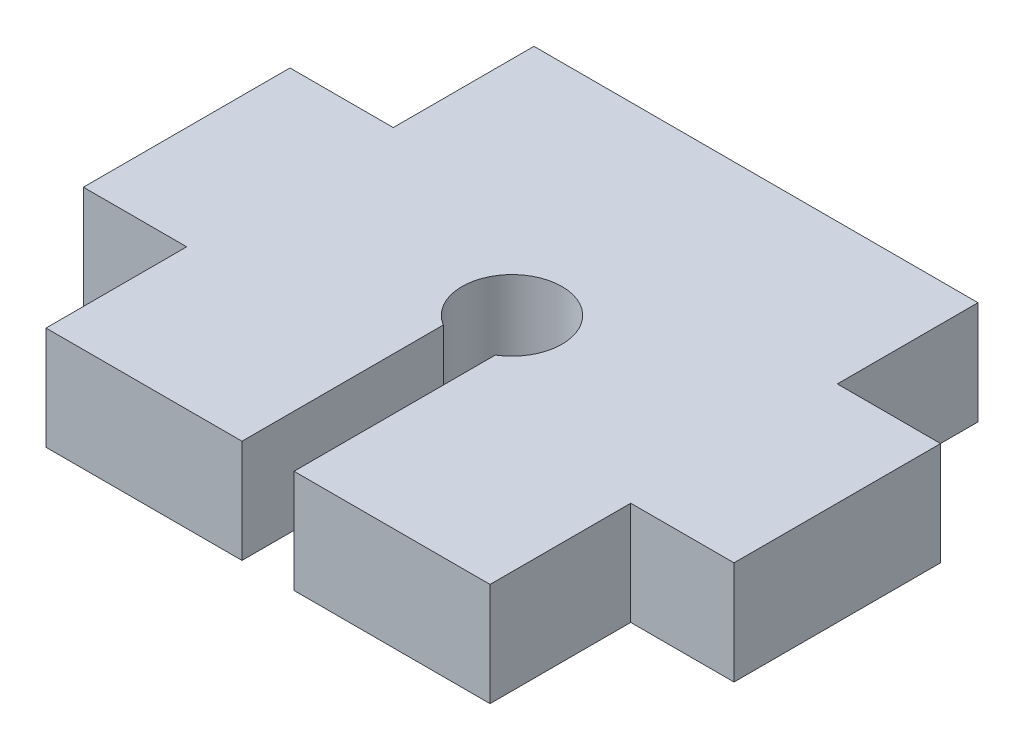
ISO-10303-21;
HEADER;
FILE_DESCRIPTION(('STEP AP214'),'2;1');
FILE_NAME('part.step','',(''),(''),'','','');
FILE_SCHEMA(('AUTOMOTIVE_DESIGN { 1 0 10303 214 1 1 1 1 }'));
ENDSEC;
DATA;
#1=APPLICATION_CONTEXT('core data for automotive mechanical design processes');
#2=APPLICATION_PROTOCOL_DEFINITION('international standard','automotive_design',2000,#1);
#3=PRODUCT_CONTEXT('',#1,'mechanical');
#4=PRODUCT('Part','Part','',(#3));
#5=PRODUCT_RELATED_PRODUCT_CATEGORY('part','',(#4));
#6=PRODUCT_DEFINITION_FORMATION('','',#4);
#7=PRODUCT_DEFINITION_CONTEXT('part definition',#1,'design');
#8=PRODUCT_DEFINITION('design','',#6,#7);
#9=PRODUCT_DEFINITION_SHAPE('','',#8);
#10=(LENGTH_UNIT() NAMED_UNIT(*) SI_UNIT(.MILLI.,.METRE.));
#11=(NAMED_UNIT(*) PLANE_ANGLE_UNIT() SI_UNIT($,.RADIAN.));
#12=(NAMED_UNIT(*) SI_UNIT($,.STERADIAN.) SOLID_ANGLE_UNIT());
#13=UNCERTAINTY_MEASURE_WITH_UNIT(LENGTH_MEASURE(1.E-05),#10,'distance_accuracy_value','');
#14=(GEOMETRIC_REPRESENTATION_CONTEXT(3) GLOBAL_UNCERTAINTY_ASSIGNED_CONTEXT((#13)) GLOBAL_UNIT_ASSIGNED_CONTEXT((#10,
#11,#12)) REPRESENTATION_CONTEXT('',''));
#15=CARTESIAN_POINT('',(0.,0.,0.));
#16=DIRECTION('',(0.,0.,1.));
#17=DIRECTION('',(1.,0.,0.));
#18=AXIS2_PLACEMENT_3D('',#15,#16,#17);
#19=CARTESIAN_POINT('',(-13.65,6.35,15.));
#20=DIRECTION('',(0.,0.,-1.));
#21=DIRECTION('',(-1.,0.,0.));
#22=AXIS2_PLACEMENT_3D('',#19,#20,#21);
#23=PLANE('',#22);
#24=DIRECTION('',(1.,0.,0.));
#25=VECTOR('',#24,1.);
#26=CARTESIAN_POINT('',(-13.65,0.,15.));
#27=LINE('',#26,#25);
#28=CARTESIAN_POINT('',(-13.65,0.,15.));
#29=VERTEX_POINT('',#28);
#30=CARTESIAN_POINT('',(-1.6,0.,15.));
#31=VERTEX_POINT('',#30);
#32=EDGE_CURVE('E230',#29,#31,#27,.T.);
#33=ORIENTED_EDGE('',*,*,#32,.T.);
#34=DIRECTION('',(0.,-1.,0.));
#35=VECTOR('',#34,1.);
#36=CARTESIAN_POINT('',(-1.6,0.,15.));
#37=LINE('',#36,#35);
#38=CARTESIAN_POINT('',(-1.6,6.35,15.));
#39=VERTEX_POINT('',#38);
#40=EDGE_CURVE('E462',#39,#31,#37,.T.);
#41=ORIENTED_EDGE('',*,*,#40,.F.);
#42=DIRECTION('',(1.,0.,0.));
#43=VECTOR('',#42,1.);
#44=CARTESIAN_POINT('',(-13.65,6.35,15.));
#45=LINE('',#44,#43);
#46=CARTESIAN_POINT('',(-13.65,6.35,15.));
#47=VERTEX_POINT('',#46);
#48=EDGE_CURVE('E253',#47,#39,#45,.T.);
#49=ORIENTED_EDGE('',*,*,#48,.F.);
#50=DIRECTION('',(0.,-1.,0.));
#51=VECTOR('',#50,1.);
#52=CARTESIAN_POINT('',(-13.65,6.35,15.));
#53=LINE('',#52,#51);
#54=EDGE_CURVE('E252',#47,#29,#53,.T.);
#55=ORIENTED_EDGE('',*,*,#54,.T.);
#56=EDGE_LOOP('',(#33,#41,#49,#55));
#57=FACE_BOUND('',#56,.T.);
#58=ADVANCED_FACE('F34',(#57),#23,.F.);
#59=CARTESIAN_POINT('',(-13.65,6.35,15.));
#60=DIRECTION('',(1.,0.,0.));
#61=DIRECTION('',(0.,0.,-1.));
#62=AXIS2_PLACEMENT_3D('',#59,#60,#61);
#63=PLANE('',#62);
#64=DIRECTION('',(0.,0.,1.));
#65=VECTOR('',#64,1.);
#66=CARTESIAN_POINT('',(-13.65,6.35,15.));
#67=LINE('',#66,#65);
#68=CARTESIAN_POINT('',(-13.65,6.35,6.35));
#69=VERTEX_POINT('',#68);
#70=EDGE_CURVE('E227',#69,#47,#67,.T.);
#71=ORIENTED_EDGE('',*,*,#70,.F.);
#72=DIRECTION('',(0.,-1.,0.));
#73=VECTOR('',#72,1.);
#74=CARTESIAN_POINT('',(-13.65,0.,6.35));
#75=LINE('',#74,#73);
#76=CARTESIAN_POINT('',(-13.65,0.,6.35));
#77=VERTEX_POINT('',#76);
#78=EDGE_CURVE('E165',#69,#77,#75,.T.);
#79=ORIENTED_EDGE('',*,*,#78,.T.);
#80=DIRECTION('',(0.,0.,1.));
#81=VECTOR('',#80,1.);
#82=CARTESIAN_POINT('',(-13.65,0.,15.));
#83=LINE('',#82,#81);
#84=EDGE_CURVE('E225',#77,#29,#83,.T.);
#85=ORIENTED_EDGE('',*,*,#84,.T.);
#86=ORIENTED_EDGE('',*,*,#54,.F.);
#87=EDGE_LOOP('',(#71,#79,#85,#86));
#88=FACE_BOUND('',#87,.T.);
#89=ADVANCED_FACE('F223',(#88),#63,.F.);
#90=CARTESIAN_POINT('',(13.65,6.35,15.));
#91=DIRECTION('',(-1.,0.,0.));
#92=DIRECTION('',(0.,0.,1.));
#93=AXIS2_PLACEMENT_3D('',#90,#91,#92);
#94=PLANE('',#93);
#95=DIRECTION('',(0.,-1.,0.));
#96=VECTOR('',#95,1.);
#97=CARTESIAN_POINT('',(13.65,0.,6.35));
#98=LINE('',#97,#96);
#99=CARTESIAN_POINT('',(13.65,6.35,6.35));
#100=VERTEX_POINT('',#99);
#101=CARTESIAN_POINT('',(13.65,0.,6.35));
#102=VERTEX_POINT('',#101);
#103=EDGE_CURVE('E196',#100,#102,#98,.T.);
#104=ORIENTED_EDGE('',*,*,#103,.F.);
#105=DIRECTION('',(0.,0.,-1.));
#106=VECTOR('',#105,1.);
#107=CARTESIAN_POINT('',(13.65,6.35,15.));
#108=LINE('',#107,#106);
#109=CARTESIAN_POINT('',(13.65,6.35,15.));
#110=VERTEX_POINT('',#109);
#111=EDGE_CURVE('E271',#110,#100,#108,.T.);
#112=ORIENTED_EDGE('',*,*,#111,.F.);
#113=DIRECTION('',(0.,-1.,0.));
#114=VECTOR('',#113,1.);
#115=CARTESIAN_POINT('',(13.65,6.35,15.));
#116=LINE('',#115,#114);
#117=CARTESIAN_POINT('',(13.65,0.,15.));
#118=VERTEX_POINT('',#117);
#119=EDGE_CURVE('E249',#110,#118,#116,.T.);
#120=ORIENTED_EDGE('',*,*,#119,.T.);
#121=DIRECTION('',(0.,0.,-1.));
#122=VECTOR('',#121,1.);
#123=CARTESIAN_POINT('',(13.65,0.,15.));
#124=LINE('',#123,#122);
#125=EDGE_CURVE('E236',#118,#102,#124,.T.);
#126=ORIENTED_EDGE('',*,*,#125,.T.);
#127=EDGE_LOOP('',(#104,#112,#120,#126));
#128=FACE_BOUND('',#127,.T.);
#129=ADVANCED_FACE('F36',(#128),#94,.F.);
#130=DIRECTION('',(0.,1.,0.));
#131=VECTOR('',#130,1.);
#132=CARTESIAN_POINT('',(13.65,0.,-6.35));
#133=LINE('',#132,#131);
#134=CARTESIAN_POINT('',(13.65,0.,-6.35));
#135=VERTEX_POINT('',#134);
#136=CARTESIAN_POINT('',(13.65,6.35,-6.35));
#137=VERTEX_POINT('',#136);
#138=EDGE_CURVE('E202',#135,#137,#133,.T.);
#139=ORIENTED_EDGE('',*,*,#138,.F.);
#140=CARTESIAN_POINT('',(13.65,0.,-15.));
#141=VERTEX_POINT('',#140);
#142=EDGE_CURVE('E258',#135,#141,#124,.T.);
#143=ORIENTED_EDGE('',*,*,#142,.T.);
#144=DIRECTION('',(0.,-1.,0.));
#145=VECTOR('',#144,1.);
#146=CARTESIAN_POINT('',(13.65,6.35,-15.));
#147=LINE('',#146,#145);
#148=CARTESIAN_POINT('',(13.65,6.35,-15.));
#149=VERTEX_POINT('',#148);
#150=EDGE_CURVE('E11',#149,#141,#147,.T.);
#151=ORIENTED_EDGE('',*,*,#150,.F.);
#152=EDGE_CURVE('E248',#137,#149,#108,.T.);
#153=ORIENTED_EDGE('',*,*,#152,.F.);
#154=EDGE_LOOP('',(#139,#143,#151,#153));
#155=FACE_BOUND('',#154,.T.);
#156=ADVANCED_FACE('F352',(#155),#94,.F.);
#157=CARTESIAN_POINT('',(-13.65,6.35,-15.));
#158=DIRECTION('',(0.,0.,1.));
#159=DIRECTION('',(1.,0.,0.));
#160=AXIS2_PLACEMENT_3D('',#157,#158,#159);
#161=PLANE('',#160);
#162=DIRECTION('',(-1.,0.,0.));
#163=VECTOR('',#162,1.);
#164=CARTESIAN_POINT('',(-13.65,0.,-15.));
#165=LINE('',#164,#163);
#166=CARTESIAN_POINT('',(-13.65,0.,-15.));
#167=VERTEX_POINT('',#166);
#168=EDGE_CURVE('E232',#141,#167,#165,.T.);
#169=ORIENTED_EDGE('',*,*,#168,.T.);
#170=DIRECTION('',(0.,-1.,0.));
#171=VECTOR('',#170,1.);
#172=CARTESIAN_POINT('',(-13.65,6.35,-15.));
#173=LINE('',#172,#171);
#174=CARTESIAN_POINT('',(-13.65,6.35,-15.));
#175=VERTEX_POINT('',#174);
#176=EDGE_CURVE('E43',#175,#167,#173,.T.);
#177=ORIENTED_EDGE('',*,*,#176,.F.);
#178=DIRECTION('',(-1.,0.,0.));
#179=VECTOR('',#178,1.);
#180=CARTESIAN_POINT('',(-13.65,6.35,-15.));
#181=LINE('',#180,#179);
#182=EDGE_CURVE('E267',#149,#175,#181,.T.);
#183=ORIENTED_EDGE('',*,*,#182,.F.);
#184=ORIENTED_EDGE('',*,*,#150,.T.);
#185=EDGE_LOOP('',(#169,#177,#183,#184));
#186=FACE_BOUND('',#185,.T.);
#187=ADVANCED_FACE('F349',(#186),#161,.F.);
#188=CARTESIAN_POINT('',(-13.65,0.,-6.35));
#189=VERTEX_POINT('',#188);
#190=EDGE_CURVE('E231',#167,#189,#83,.T.);
#191=ORIENTED_EDGE('',*,*,#190,.T.);
#192=DIRECTION('',(0.,1.,0.));
#193=VECTOR('',#192,1.);
#194=CARTESIAN_POINT('',(-13.65,0.,-6.35));
#195=LINE('',#194,#193);
#196=CARTESIAN_POINT('',(-13.65,6.35,-6.35));
#197=VERTEX_POINT('',#196);
#198=EDGE_CURVE('E168',#189,#197,#195,.T.);
#199=ORIENTED_EDGE('',*,*,#198,.T.);
#200=EDGE_CURVE('E241',#175,#197,#67,.T.);
#201=ORIENTED_EDGE('',*,*,#200,.F.);
#202=ORIENTED_EDGE('',*,*,#176,.T.);
#203=EDGE_LOOP('',(#191,#199,#201,#202));
#204=FACE_BOUND('',#203,.T.);
#205=ADVANCED_FACE('F338',(#204),#63,.F.);
#206=CARTESIAN_POINT('',(1.6,6.35,15.));
#207=VERTEX_POINT('',#206);
#208=EDGE_CURVE('E264',#207,#110,#45,.T.);
#209=ORIENTED_EDGE('',*,*,#208,.F.);
#210=DIRECTION('',(0.,1.,0.));
#211=VECTOR('',#210,1.);
#212=CARTESIAN_POINT('',(1.6,0.,15.));
#213=LINE('',#212,#211);
#214=CARTESIAN_POINT('',(1.6,0.,15.));
#215=VERTEX_POINT('',#214);
#216=EDGE_CURVE('E460',#215,#207,#213,.T.);
#217=ORIENTED_EDGE('',*,*,#216,.F.);
#218=EDGE_CURVE('E162',#215,#118,#27,.T.);
#219=ORIENTED_EDGE('',*,*,#218,.T.);
#220=ORIENTED_EDGE('',*,*,#119,.F.);
#221=EDGE_LOOP('',(#209,#217,#219,#220));
#222=FACE_BOUND('',#221,.T.);
#223=ADVANCED_FACE('F331',(#222),#23,.F.);
#224=CARTESIAN_POINT('',(0.,6.35,0.));
#225=DIRECTION('',(0.,-1.,0.));
#226=DIRECTION('',(0.,0.,-1.));
#227=AXIS2_PLACEMENT_3D('',#224,#225,#226);
#228=PLANE('',#227);
#229=ORIENTED_EDGE('',*,*,#48,.T.);
#230=DIRECTION('',(0.,0.,1.));
#231=VECTOR('',#230,1.);
#232=CARTESIAN_POINT('',(-1.6,6.35,-15.001025));
#233=LINE('',#232,#231);
#234=CARTESIAN_POINT('',(-1.6,6.35,2.62595220824751));
#235=VERTEX_POINT('',#234);
#236=EDGE_CURVE('E458',#235,#39,#233,.T.);
#237=ORIENTED_EDGE('',*,*,#236,.F.);
#238=CARTESIAN_POINT('',(0.,6.35,0.));
#239=DIRECTION('',(0.,1.,0.));
#240=DIRECTION('',(0.,0.,1.));
#241=AXIS2_PLACEMENT_3D('',#238,#239,#240);
#242=CIRCLE('',#241,3.075);
#243=CARTESIAN_POINT('',(1.6,6.35,2.62595220824752));
#244=VERTEX_POINT('',#243);
#245=EDGE_CURVE('E166',#244,#235,#242,.T.);
#246=ORIENTED_EDGE('',*,*,#245,.F.);
#247=DIRECTION('',(0.,0.,1.));
#248=VECTOR('',#247,1.);
#249=CARTESIAN_POINT('',(1.6,6.35,-15.001025));
#250=LINE('',#249,#248);
#251=EDGE_CURVE('E51',#244,#207,#250,.T.);
#252=ORIENTED_EDGE('',*,*,#251,.T.);
#253=ORIENTED_EDGE('',*,*,#208,.T.);
#254=ORIENTED_EDGE('',*,*,#111,.T.);
#255=DIRECTION('',(-1.,0.,0.));
#256=VECTOR('',#255,1.);
#257=CARTESIAN_POINT('',(20.,6.35,6.35));
#258=LINE('',#257,#256);
#259=CARTESIAN_POINT('',(20.,6.35,6.35));
#260=VERTEX_POINT('',#259);
#261=EDGE_CURVE('E294',#260,#100,#258,.T.);
#262=ORIENTED_EDGE('',*,*,#261,.F.);
#263=DIRECTION('',(0.,0.,1.));
#264=VECTOR('',#263,1.);
#265=CARTESIAN_POINT('',(20.,6.35,-6.35));
#266=LINE('',#265,#264);
#267=CARTESIAN_POINT('',(20.,6.35,-6.35));
#268=VERTEX_POINT('',#267);
#269=EDGE_CURVE('E306',#268,#260,#266,.T.);
#270=ORIENTED_EDGE('',*,*,#269,.F.);
#271=DIRECTION('',(-1.,0.,0.));
#272=VECTOR('',#271,1.);
#273=CARTESIAN_POINT('',(20.,6.35,-6.35));
#274=LINE('',#273,#272);
#275=EDGE_CURVE('E290',#268,#137,#274,.T.);
#276=ORIENTED_EDGE('',*,*,#275,.T.);
#277=ORIENTED_EDGE('',*,*,#152,.T.);
#278=ORIENTED_EDGE('',*,*,#182,.T.);
#279=ORIENTED_EDGE('',*,*,#200,.T.);
#280=DIRECTION('',(1.,0.,0.));
#281=VECTOR('',#280,1.);
#282=CARTESIAN_POINT('',(-20.,6.35,-6.35));
#283=LINE('',#282,#281);
#284=CARTESIAN_POINT('',(-20.,6.35,-6.35));
#285=VERTEX_POINT('',#284);
#286=EDGE_CURVE('E197',#285,#197,#283,.T.);
#287=ORIENTED_EDGE('',*,*,#286,.F.);
#288=DIRECTION('',(0.,0.,1.));
#289=VECTOR('',#288,1.);
#290=CARTESIAN_POINT('',(-20.,6.35,-6.35));
#291=LINE('',#290,#289);
#292=CARTESIAN_POINT('',(-20.,6.35,6.35));
#293=VERTEX_POINT('',#292);
#294=EDGE_CURVE('E177',#285,#293,#291,.T.);
#295=ORIENTED_EDGE('',*,*,#294,.T.);
#296=DIRECTION('',(1.,0.,0.));
#297=VECTOR('',#296,1.);
#298=CARTESIAN_POINT('',(-20.,6.35,6.35));
#299=LINE('',#298,#297);
#300=EDGE_CURVE('E195',#293,#69,#299,.T.);
#301=ORIENTED_EDGE('',*,*,#300,.T.);
#302=ORIENTED_EDGE('',*,*,#70,.T.);
#303=EDGE_LOOP('',(#229,#237,#246,#252,#253,#254,#262,#270,#276,#277,#278,#279,#287,#295,#301,#302));
#304=FACE_BOUND('',#303,.T.);
#305=ADVANCED_FACE('F327',(#304),#228,.F.);
#306=CARTESIAN_POINT('',(0.,0.,0.));
#307=DIRECTION('',(0.,-1.,0.));
#308=DIRECTION('',(0.,0.,-1.));
#309=AXIS2_PLACEMENT_3D('',#306,#307,#308);
#310=PLANE('',#309);
#311=DIRECTION('',(0.,0.,1.));
#312=VECTOR('',#311,1.);
#313=CARTESIAN_POINT('',(-1.6,0.,-15.001025));
#314=LINE('',#313,#312);
#315=CARTESIAN_POINT('',(-1.6,0.,2.62595220824751));
#316=VERTEX_POINT('',#315);
#317=EDGE_CURVE('E59',#316,#31,#314,.T.);
#318=ORIENTED_EDGE('',*,*,#317,.T.);
#319=ORIENTED_EDGE('',*,*,#32,.F.);
#320=ORIENTED_EDGE('',*,*,#84,.F.);
#321=DIRECTION('',(1.,0.,0.));
#322=VECTOR('',#321,1.);
#323=CARTESIAN_POINT('',(-20.,0.,6.35));
#324=LINE('',#323,#322);
#325=CARTESIAN_POINT('',(-20.,0.,6.35));
#326=VERTEX_POINT('',#325);
#327=EDGE_CURVE('E186',#326,#77,#324,.T.);
#328=ORIENTED_EDGE('',*,*,#327,.F.);
#329=DIRECTION('',(0.,0.,-1.));
#330=VECTOR('',#329,1.);
#331=CARTESIAN_POINT('',(-20.,0.,-6.35));
#332=LINE('',#331,#330);
#333=CARTESIAN_POINT('',(-20.,0.,-6.35));
#334=VERTEX_POINT('',#333);
#335=EDGE_CURVE('E183',#326,#334,#332,.T.);
#336=ORIENTED_EDGE('',*,*,#335,.T.);
#337=DIRECTION('',(1.,0.,0.));
#338=VECTOR('',#337,1.);
#339=CARTESIAN_POINT('',(-20.,0.,-6.35));
#340=LINE('',#339,#338);
#341=EDGE_CURVE('E204',#334,#189,#340,.T.);
#342=ORIENTED_EDGE('',*,*,#341,.T.);
#343=ORIENTED_EDGE('',*,*,#190,.F.);
#344=ORIENTED_EDGE('',*,*,#168,.F.);
#345=ORIENTED_EDGE('',*,*,#142,.F.);
#346=DIRECTION('',(-1.,0.,0.));
#347=VECTOR('',#346,1.);
#348=CARTESIAN_POINT('',(20.,0.,-6.35));
#349=LINE('',#348,#347);
#350=CARTESIAN_POINT('',(20.,0.,-6.35));
#351=VERTEX_POINT('',#350);
#352=EDGE_CURVE('E293',#351,#135,#349,.T.);
#353=ORIENTED_EDGE('',*,*,#352,.F.);
#354=DIRECTION('',(0.,0.,-1.));
#355=VECTOR('',#354,1.);
#356=CARTESIAN_POINT('',(20.,0.,-6.35));
#357=LINE('',#356,#355);
#358=CARTESIAN_POINT('',(20.,0.,6.35));
#359=VERTEX_POINT('',#358);
#360=EDGE_CURVE('E314',#359,#351,#357,.T.);
#361=ORIENTED_EDGE('',*,*,#360,.F.);
#362=DIRECTION('',(-1.,0.,0.));
#363=VECTOR('',#362,1.);
#364=CARTESIAN_POINT('',(20.,0.,6.35));
#365=LINE('',#364,#363);
#366=EDGE_CURVE('E299',#359,#102,#365,.T.);
#367=ORIENTED_EDGE('',*,*,#366,.T.);
#368=ORIENTED_EDGE('',*,*,#125,.F.);
#369=ORIENTED_EDGE('',*,*,#218,.F.);
#370=DIRECTION('',(0.,0.,1.));
#371=VECTOR('',#370,1.);
#372=CARTESIAN_POINT('',(1.6,0.,-15.001025));
#373=LINE('',#372,#371);
#374=CARTESIAN_POINT('',(1.6,0.,2.62595220824752));
#375=VERTEX_POINT('',#374);
#376=EDGE_CURVE('E149',#375,#215,#373,.T.);
#377=ORIENTED_EDGE('',*,*,#376,.F.);
#378=CARTESIAN_POINT('',(0.,0.,0.));
#379=DIRECTION('',(0.,-1.,0.));
#380=DIRECTION('',(0.,0.,-1.));
#381=AXIS2_PLACEMENT_3D('',#378,#379,#380);
#382=CIRCLE('',#381,3.075);
#383=EDGE_CURVE('E38',#316,#375,#382,.T.);
#384=ORIENTED_EDGE('',*,*,#383,.F.);
#385=EDGE_LOOP('',(#318,#319,#320,#328,#336,#342,#343,#344,#345,#353,#361,#367,#368,#369,#377,#384));
#386=FACE_BOUND('',#385,.T.);
#387=ADVANCED_FACE('F160',(#386),#310,.T.);
#388=CARTESIAN_POINT('',(20.,0.,6.35));
#389=DIRECTION('',(0.,0.,-1.));
#390=DIRECTION('',(-1.,0.,0.));
#391=AXIS2_PLACEMENT_3D('',#388,#389,#390);
#392=PLANE('',#391);
#393=ORIENTED_EDGE('',*,*,#103,.T.);
#394=ORIENTED_EDGE('',*,*,#366,.F.);
#395=DIRECTION('',(0.,-1.,0.));
#396=VECTOR('',#395,1.);
#397=CARTESIAN_POINT('',(20.,0.,6.35));
#398=LINE('',#397,#396);
#399=EDGE_CURVE('E289',#260,#359,#398,.T.);
#400=ORIENTED_EDGE('',*,*,#399,.F.);
#401=ORIENTED_EDGE('',*,*,#261,.T.);
#402=EDGE_LOOP('',(#393,#394,#400,#401));
#403=FACE_BOUND('',#402,.T.);
#404=ADVANCED_FACE('F320',(#403),#392,.F.);
#405=CARTESIAN_POINT('',(20.,0.,-6.35));
#406=DIRECTION('',(0.,0.,1.));
#407=DIRECTION('',(1.,0.,0.));
#408=AXIS2_PLACEMENT_3D('',#405,#406,#407);
#409=PLANE('',#408);
#410=ORIENTED_EDGE('',*,*,#138,.T.);
#411=ORIENTED_EDGE('',*,*,#275,.F.);
#412=DIRECTION('',(0.,1.,0.));
#413=VECTOR('',#412,1.);
#414=CARTESIAN_POINT('',(20.,0.,-6.35));
#415=LINE('',#414,#413);
#416=EDGE_CURVE('E310',#351,#268,#415,.T.);
#417=ORIENTED_EDGE('',*,*,#416,.F.);
#418=ORIENTED_EDGE('',*,*,#352,.T.);
#419=EDGE_LOOP('',(#410,#411,#417,#418));
#420=FACE_BOUND('',#419,.T.);
#421=ADVANCED_FACE('F326',(#420),#409,.F.);
#422=CARTESIAN_POINT('',(20.,0.,0.));
#423=DIRECTION('',(1.,0.,0.));
#424=DIRECTION('',(0.,0.,-1.));
#425=AXIS2_PLACEMENT_3D('',#422,#423,#424);
#426=PLANE('',#425);
#427=ORIENTED_EDGE('',*,*,#399,.T.);
#428=ORIENTED_EDGE('',*,*,#360,.T.);
#429=ORIENTED_EDGE('',*,*,#416,.T.);
#430=ORIENTED_EDGE('',*,*,#269,.T.);
#431=EDGE_LOOP('',(#427,#428,#429,#430));
#432=FACE_BOUND('',#431,.T.);
#433=ADVANCED_FACE('F318',(#432),#426,.T.);
#434=CARTESIAN_POINT('',(-20.,0.,6.35));
#435=DIRECTION('',(0.,0.,1.));
#436=DIRECTION('',(1.,0.,0.));
#437=AXIS2_PLACEMENT_3D('',#434,#435,#436);
#438=PLANE('',#437);
#439=ORIENTED_EDGE('',*,*,#78,.F.);
#440=ORIENTED_EDGE('',*,*,#300,.F.);
#441=DIRECTION('',(0.,-1.,0.));
#442=VECTOR('',#441,1.);
#443=CARTESIAN_POINT('',(-20.,0.,6.35));
#444=LINE('',#443,#442);
#445=EDGE_CURVE('E174',#293,#326,#444,.T.);
#446=ORIENTED_EDGE('',*,*,#445,.T.);
#447=ORIENTED_EDGE('',*,*,#327,.T.);
#448=EDGE_LOOP('',(#439,#440,#446,#447));
#449=FACE_BOUND('',#448,.T.);
#450=ADVANCED_FACE('F217',(#449),#438,.T.);
#451=CARTESIAN_POINT('',(-20.,0.,-6.35));
#452=DIRECTION('',(0.,0.,-1.));
#453=DIRECTION('',(-1.,0.,0.));
#454=AXIS2_PLACEMENT_3D('',#451,#452,#453);
#455=PLANE('',#454);
#456=ORIENTED_EDGE('',*,*,#198,.F.);
#457=ORIENTED_EDGE('',*,*,#341,.F.);
#458=DIRECTION('',(0.,1.,0.));
#459=VECTOR('',#458,1.);
#460=CARTESIAN_POINT('',(-20.,0.,-6.35));
#461=LINE('',#460,#459);
#462=EDGE_CURVE('E180',#334,#285,#461,.T.);
#463=ORIENTED_EDGE('',*,*,#462,.T.);
#464=ORIENTED_EDGE('',*,*,#286,.T.);
#465=EDGE_LOOP('',(#456,#457,#463,#464));
#466=FACE_BOUND('',#465,.T.);
#467=ADVANCED_FACE('F362',(#466),#455,.T.);
#468=CARTESIAN_POINT('',(-20.,0.,0.));
#469=DIRECTION('',(-1.,0.,0.));
#470=DIRECTION('',(0.,0.,-1.));
#471=AXIS2_PLACEMENT_3D('',#468,#469,#470);
#472=PLANE('',#471);
#473=ORIENTED_EDGE('',*,*,#445,.F.);
#474=ORIENTED_EDGE('',*,*,#294,.F.);
#475=ORIENTED_EDGE('',*,*,#462,.F.);
#476=ORIENTED_EDGE('',*,*,#335,.F.);
#477=EDGE_LOOP('',(#473,#474,#475,#476));
#478=FACE_BOUND('',#477,.T.);
#479=ADVANCED_FACE('F365',(#478),#472,.T.);
#480=CARTESIAN_POINT('',(0.,-5.00000000014378E-05,0.));
#481=DIRECTION('',(0.,1.,0.));
#482=DIRECTION('',(0.,0.,1.));
#483=AXIS2_PLACEMENT_3D('',#480,#481,#482);
#484=CYLINDRICAL_SURFACE('',#483,3.075);
#485=ORIENTED_EDGE('',*,*,#245,.T.);
#486=DIRECTION('',(0.,1.,0.));
#487=VECTOR('',#486,1.);
#488=CARTESIAN_POINT('',(-1.6,-5.00000000014378E-05,2.62595220824751));
#489=LINE('',#488,#487);
#490=EDGE_CURVE('E155',#316,#235,#489,.T.);
#491=ORIENTED_EDGE('',*,*,#490,.F.);
#492=ORIENTED_EDGE('',*,*,#383,.T.);
#493=DIRECTION('',(0.,1.,0.));
#494=VECTOR('',#493,1.);
#495=CARTESIAN_POINT('',(1.6,-5.00000000014378E-05,2.62595220824752));
#496=LINE('',#495,#494);
#497=EDGE_CURVE('E146',#244,#375,#496,.F.);
#498=ORIENTED_EDGE('',*,*,#497,.F.);
#499=EDGE_LOOP('',(#485,#491,#492,#498));
#500=FACE_BOUND('',#499,.T.);
#501=ADVANCED_FACE('F164',(#500),#484,.F.);
#502=CARTESIAN_POINT('',(1.6,0.,-15.001025));
#503=DIRECTION('',(1.,0.,0.));
#504=DIRECTION('',(0.,0.,-1.));
#505=AXIS2_PLACEMENT_3D('',#502,#503,#504);
#506=PLANE('',#505);
#507=ORIENTED_EDGE('',*,*,#497,.T.);
#508=ORIENTED_EDGE('',*,*,#376,.T.);
#509=ORIENTED_EDGE('',*,*,#216,.T.);
#510=ORIENTED_EDGE('',*,*,#251,.F.);
#511=EDGE_LOOP('',(#507,#508,#509,#510));
#512=FACE_BOUND('',#511,.T.);
#513=ADVANCED_FACE('F148',(#512),#506,.F.);
#514=CARTESIAN_POINT('',(-1.6,0.,-15.001025));
#515=DIRECTION('',(-1.,0.,0.));
#516=DIRECTION('',(0.,0.,1.));
#517=AXIS2_PLACEMENT_3D('',#514,#515,#516);
#518=PLANE('',#517);
#519=ORIENTED_EDGE('',*,*,#490,.T.);
#520=ORIENTED_EDGE('',*,*,#236,.T.);
#521=ORIENTED_EDGE('',*,*,#40,.T.);
#522=ORIENTED_EDGE('',*,*,#317,.F.);
#523=EDGE_LOOP('',(#519,#520,#521,#522));
#524=FACE_BOUND('',#523,.T.);
#525=ADVANCED_FACE('F447',(#524),#518,.F.);
#526=CLOSED_SHELL('',(#58,#89,#129,#156,#187,#205,#223,#305,#387,#404,#421,#433,#450,#467,#479,
#501,#513,#525));
#527=MANIFOLD_SOLID_BREP('B2',#526);
#528=ADVANCED_BREP_SHAPE_REPRESENTATION('',(#18,#527),#14);
#529=SHAPE_DEFINITION_REPRESENTATION(#9,#528);
ENDSEC;
END-ISO-10303-21;
